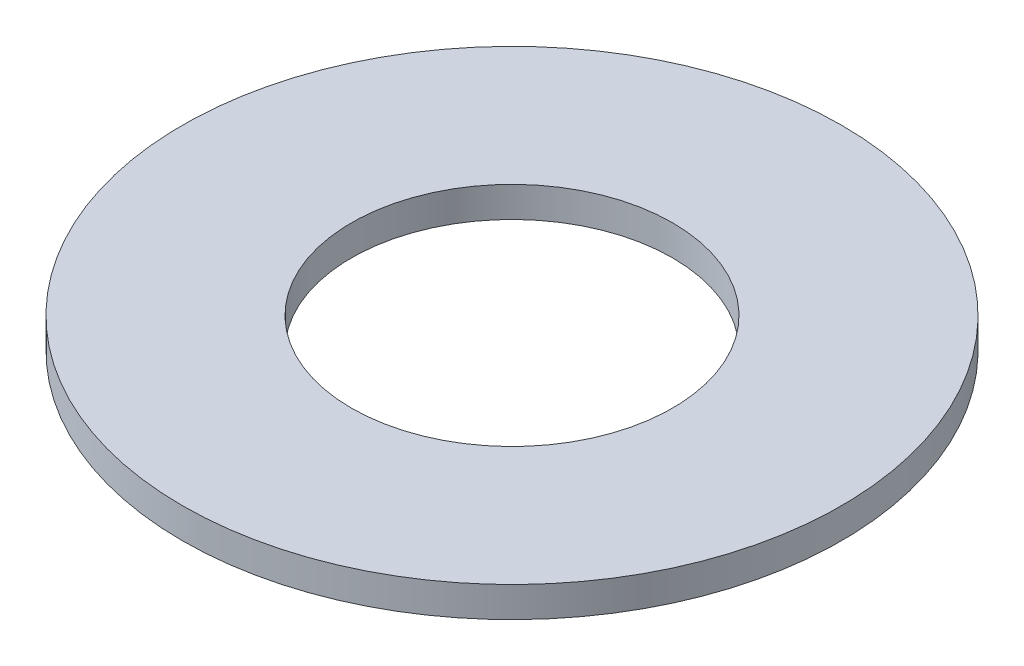
ISO-10303-21;
HEADER;
FILE_DESCRIPTION(('STEP AP214'),'2;1');
FILE_NAME('part.step','',(''),(''),'','','');
FILE_SCHEMA(('AUTOMOTIVE_DESIGN { 1 0 10303 214 1 1 1 1 }'));
ENDSEC;
DATA;
#1=APPLICATION_CONTEXT('core data for automotive mechanical design processes');
#2=APPLICATION_PROTOCOL_DEFINITION('international standard','automotive_design',2000,#1);
#3=PRODUCT_CONTEXT('',#1,'mechanical');
#4=PRODUCT('Part','Part','',(#3));
#5=PRODUCT_RELATED_PRODUCT_CATEGORY('part','',(#4));
#6=PRODUCT_DEFINITION_FORMATION('','',#4);
#7=PRODUCT_DEFINITION_CONTEXT('part definition',#1,'design');
#8=PRODUCT_DEFINITION('design','',#6,#7);
#9=PRODUCT_DEFINITION_SHAPE('','',#8);
#10=(LENGTH_UNIT() NAMED_UNIT(*) SI_UNIT(.MILLI.,.METRE.));
#11=(NAMED_UNIT(*) PLANE_ANGLE_UNIT() SI_UNIT($,.RADIAN.));
#12=(NAMED_UNIT(*) SI_UNIT($,.STERADIAN.) SOLID_ANGLE_UNIT());
#13=UNCERTAINTY_MEASURE_WITH_UNIT(LENGTH_MEASURE(1.E-05),#10,'distance_accuracy_value','');
#14=(GEOMETRIC_REPRESENTATION_CONTEXT(3) GLOBAL_UNCERTAINTY_ASSIGNED_CONTEXT((#13)) GLOBAL_UNIT_ASSIGNED_CONTEXT((#10,
#11,#12)) REPRESENTATION_CONTEXT('',''));
#15=CARTESIAN_POINT('',(0.,0.,0.));
#16=DIRECTION('',(0.,0.,1.));
#17=DIRECTION('',(1.,0.,0.));
#18=AXIS2_PLACEMENT_3D('',#15,#16,#17);
#19=CARTESIAN_POINT('',(0.,9.,0.));
#20=DIRECTION('',(0.,-1.,0.));
#21=DIRECTION('',(0.,0.,-1.));
#22=AXIS2_PLACEMENT_3D('',#19,#20,#21);
#23=CYLINDRICAL_SURFACE('',#22,97.5);
#24=CARTESIAN_POINT('',(0.,9.,0.));
#25=DIRECTION('',(0.,1.,0.));
#26=DIRECTION('',(0.,0.,1.));
#27=AXIS2_PLACEMENT_3D('',#24,#25,#26);
#28=CIRCLE('',#27,97.5);
#29=CARTESIAN_POINT('',(0.,9.,97.5));
#30=VERTEX_POINT('',#29);
#31=EDGE_CURVE('E10',#30,#30,#28,.T.);
#32=ORIENTED_EDGE('',*,*,#31,.F.);
#33=EDGE_LOOP('',(#32));
#34=FACE_BOUND('',#33,.T.);
#35=CARTESIAN_POINT('',(0.,0.,0.));
#36=DIRECTION('',(0.,1.,0.));
#37=DIRECTION('',(0.,0.,1.));
#38=AXIS2_PLACEMENT_3D('',#35,#36,#37);
#39=CIRCLE('',#38,97.5);
#40=CARTESIAN_POINT('',(0.,0.,97.5));
#41=VERTEX_POINT('',#40);
#42=EDGE_CURVE('E37',#41,#41,#39,.T.);
#43=ORIENTED_EDGE('',*,*,#42,.T.);
#44=EDGE_LOOP('',(#43));
#45=FACE_BOUND('',#44,.T.);
#46=ADVANCED_FACE('F40',(#34,#45),#23,.T.);
#47=CARTESIAN_POINT('',(0.,9.,0.));
#48=DIRECTION('',(0.,1.,0.));
#49=DIRECTION('',(0.,0.,1.));
#50=AXIS2_PLACEMENT_3D('',#47,#48,#49);
#51=PLANE('',#50);
#52=CARTESIAN_POINT('',(0.,9.,0.));
#53=DIRECTION('',(0.,1.,0.));
#54=DIRECTION('',(0.,0.,1.));
#55=AXIS2_PLACEMENT_3D('',#52,#53,#54);
#56=CIRCLE('',#55,47.5);
#57=CARTESIAN_POINT('',(0.,9.,47.5));
#58=VERTEX_POINT('',#57);
#59=EDGE_CURVE('E50',#58,#58,#56,.T.);
#60=ORIENTED_EDGE('',*,*,#59,.F.);
#61=EDGE_LOOP('',(#60));
#62=FACE_BOUND('',#61,.T.);
#63=ORIENTED_EDGE('',*,*,#31,.T.);
#64=EDGE_LOOP('',(#63));
#65=FACE_BOUND('',#64,.T.);
#66=ADVANCED_FACE('F59',(#62,#65),#51,.T.);
#67=CARTESIAN_POINT('',(0.,0.,0.));
#68=DIRECTION('',(0.,1.,0.));
#69=DIRECTION('',(0.,0.,1.));
#70=AXIS2_PLACEMENT_3D('',#67,#68,#69);
#71=PLANE('',#70);
#72=CARTESIAN_POINT('',(0.,0.,0.));
#73=DIRECTION('',(0.,1.,0.));
#74=DIRECTION('',(0.,0.,1.));
#75=AXIS2_PLACEMENT_3D('',#72,#73,#74);
#76=CIRCLE('',#75,47.5);
#77=CARTESIAN_POINT('',(0.,0.,47.5));
#78=VERTEX_POINT('',#77);
#79=EDGE_CURVE('E47',#78,#78,#76,.T.);
#80=ORIENTED_EDGE('',*,*,#79,.T.);
#81=EDGE_LOOP('',(#80));
#82=FACE_BOUND('',#81,.T.);
#83=ORIENTED_EDGE('',*,*,#42,.F.);
#84=EDGE_LOOP('',(#83));
#85=FACE_BOUND('',#84,.T.);
#86=ADVANCED_FACE('F58',(#82,#85),#71,.F.);
#87=CARTESIAN_POINT('',(0.,9.,0.));
#88=DIRECTION('',(0.,-1.,0.));
#89=DIRECTION('',(0.,0.,-1.));
#90=AXIS2_PLACEMENT_3D('',#87,#88,#89);
#91=CYLINDRICAL_SURFACE('',#90,47.5);
#92=ORIENTED_EDGE('',*,*,#59,.T.);
#93=EDGE_LOOP('',(#92));
#94=FACE_BOUND('',#93,.T.);
#95=ORIENTED_EDGE('',*,*,#79,.F.);
#96=EDGE_LOOP('',(#95));
#97=FACE_BOUND('',#96,.T.);
#98=ADVANCED_FACE('F54',(#94,#97),#91,.F.);
#99=CLOSED_SHELL('',(#46,#66,#86,#98));
#100=MANIFOLD_SOLID_BREP('B2',#99);
#101=ADVANCED_BREP_SHAPE_REPRESENTATION('',(#18,#100),#14);
#102=SHAPE_DEFINITION_REPRESENTATION(#9,#101);
ENDSEC;
END-ISO-10303-21;
